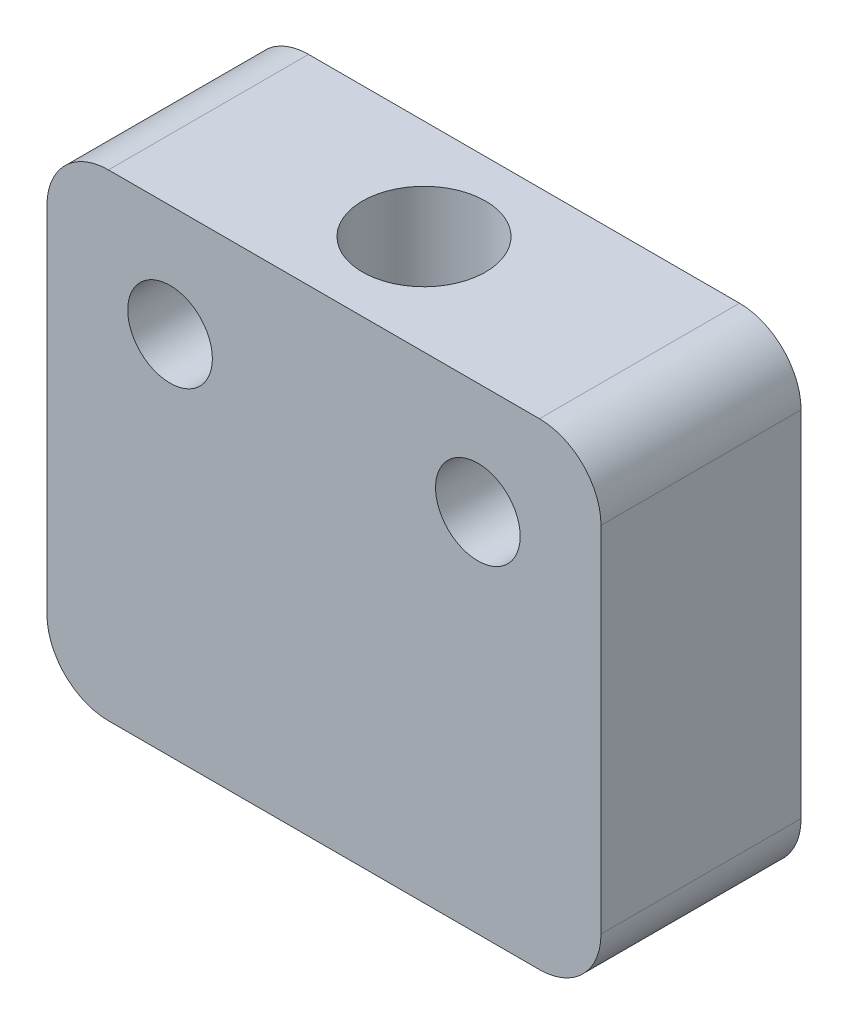
ISO-10303-21;
HEADER;
FILE_DESCRIPTION(('STEP AP214'),'2;1');
FILE_NAME('part.step','',(''),(''),'','','');
FILE_SCHEMA(('AUTOMOTIVE_DESIGN { 1 0 10303 214 1 1 1 1 }'));
ENDSEC;
DATA;
#1=APPLICATION_CONTEXT('core data for automotive mechanical design processes');
#2=APPLICATION_PROTOCOL_DEFINITION('international standard','automotive_design',2000,#1);
#3=PRODUCT_CONTEXT('',#1,'mechanical');
#4=PRODUCT('Part','Part','',(#3));
#5=PRODUCT_RELATED_PRODUCT_CATEGORY('part','',(#4));
#6=PRODUCT_DEFINITION_FORMATION('','',#4);
#7=PRODUCT_DEFINITION_CONTEXT('part definition',#1,'design');
#8=PRODUCT_DEFINITION('design','',#6,#7);
#9=PRODUCT_DEFINITION_SHAPE('','',#8);
#10=(LENGTH_UNIT() NAMED_UNIT(*) SI_UNIT(.MILLI.,.METRE.));
#11=(NAMED_UNIT(*) PLANE_ANGLE_UNIT() SI_UNIT($,.RADIAN.));
#12=(NAMED_UNIT(*) SI_UNIT($,.STERADIAN.) SOLID_ANGLE_UNIT());
#13=UNCERTAINTY_MEASURE_WITH_UNIT(LENGTH_MEASURE(1.E-05),#10,'distance_accuracy_value','');
#14=(GEOMETRIC_REPRESENTATION_CONTEXT(3) GLOBAL_UNCERTAINTY_ASSIGNED_CONTEXT((#13)) GLOBAL_UNIT_ASSIGNED_CONTEXT((#10,
#11,#12)) REPRESENTATION_CONTEXT('',''));
#15=CARTESIAN_POINT('',(0.,0.,0.));
#16=DIRECTION('',(0.,0.,1.));
#17=DIRECTION('',(1.,0.,0.));
#18=AXIS2_PLACEMENT_3D('',#15,#16,#17);
#19=CARTESIAN_POINT('',(18.0000002607703,31.000000461936,6.50000009685755));
#20=DIRECTION('',(0.,-1.,0.));
#21=DIRECTION('',(0.,0.,-1.));
#22=AXIS2_PLACEMENT_3D('',#19,#20,#21);
#23=CYLINDRICAL_SURFACE('',#22,4.);
#24=CARTESIAN_POINT('',(18.0000002607703,0.,6.50000009685755));
#25=DIRECTION('',(0.,-1.,0.));
#26=DIRECTION('',(0.,0.,-1.));
#27=AXIS2_PLACEMENT_3D('',#24,#25,#26);
#28=CIRCLE('',#27,4.);
#29=CARTESIAN_POINT('',(18.0000002607703,0.,2.50000009685755));
#30=VERTEX_POINT('',#29);
#31=EDGE_CURVE('E145',#30,#30,#28,.F.);
#32=ORIENTED_EDGE('',*,*,#31,.F.);
#33=EDGE_LOOP('',(#32));
#34=FACE_BOUND('',#33,.T.);
#35=CARTESIAN_POINT('',(18.0000002607703,31.000000461936,6.50000009685755));
#36=DIRECTION('',(0.,-1.,0.));
#37=DIRECTION('',(0.,0.,-1.));
#38=AXIS2_PLACEMENT_3D('',#35,#36,#37);
#39=CIRCLE('',#38,4.);
#40=CARTESIAN_POINT('',(18.0000002607703,31.000000461936,2.50000009685755));
#41=VERTEX_POINT('',#40);
#42=EDGE_CURVE('E102',#41,#41,#39,.T.);
#43=ORIENTED_EDGE('',*,*,#42,.F.);
#44=EDGE_LOOP('',(#43));
#45=FACE_BOUND('',#44,.T.);
#46=ADVANCED_FACE('F17',(#34,#45),#23,.F.);
#47=CARTESIAN_POINT('',(18.0000002682209,15.500000230968,0.));
#48=DIRECTION('',(0.,0.,1.));
#49=DIRECTION('',(1.,0.,0.));
#50=AXIS2_PLACEMENT_3D('',#47,#48,#49);
#51=PLANE('',#50);
#52=CARTESIAN_POINT('',(8.,23.750000461936,0.));
#53=DIRECTION('',(0.,0.,1.));
#54=DIRECTION('',(1.,0.,0.));
#55=AXIS2_PLACEMENT_3D('',#52,#53,#54);
#56=CIRCLE('',#55,2.75);
#57=CARTESIAN_POINT('',(10.75,23.750000461936,0.));
#58=VERTEX_POINT('',#57);
#59=EDGE_CURVE('E135',#58,#58,#56,.T.);
#60=ORIENTED_EDGE('',*,*,#59,.T.);
#61=EDGE_LOOP('',(#60));
#62=FACE_BOUND('',#61,.T.);
#63=CARTESIAN_POINT('',(28.0000004172325,23.750000461936,0.));
#64=DIRECTION('',(0.,0.,1.));
#65=DIRECTION('',(1.,0.,0.));
#66=AXIS2_PLACEMENT_3D('',#63,#64,#65);
#67=CIRCLE('',#66,2.75);
#68=CARTESIAN_POINT('',(30.7500004172325,23.750000461936,0.));
#69=VERTEX_POINT('',#68);
#70=EDGE_CURVE('E138',#69,#69,#67,.T.);
#71=ORIENTED_EDGE('',*,*,#70,.T.);
#72=EDGE_LOOP('',(#71));
#73=FACE_BOUND('',#72,.T.);
#74=CARTESIAN_POINT('',(32.0000004768372,4.00000005960464,0.));
#75=DIRECTION('',(0.,0.,1.));
#76=DIRECTION('',(1.,0.,0.));
#77=AXIS2_PLACEMENT_3D('',#74,#75,#76);
#78=CIRCLE('',#77,4.00000005960464);
#79=CARTESIAN_POINT('',(32.0000004768372,0.,0.));
#80=VERTEX_POINT('',#79);
#81=CARTESIAN_POINT('',(36.0000002682209,4.00207166144692,0.));
#82=VERTEX_POINT('',#81);
#83=EDGE_CURVE('E141',#80,#82,#78,.T.);
#84=ORIENTED_EDGE('',*,*,#83,.F.);
#85=DIRECTION('',(1.,0.,0.));
#86=VECTOR('',#85,1.);
#87=CARTESIAN_POINT('',(4.00000005960464,0.,0.));
#88=LINE('',#87,#86);
#89=CARTESIAN_POINT('',(4.00000005960464,0.,0.));
#90=VERTEX_POINT('',#89);
#91=EDGE_CURVE('E110',#90,#80,#88,.T.);
#92=ORIENTED_EDGE('',*,*,#91,.F.);
#93=CARTESIAN_POINT('',(4.00000005960464,4.00000005960464,0.));
#94=DIRECTION('',(0.,0.,1.));
#95=DIRECTION('',(1.,0.,0.));
#96=AXIS2_PLACEMENT_3D('',#93,#94,#95);
#97=CIRCLE('',#96,4.00000005960464);
#98=CARTESIAN_POINT('',(4.61936000692095E-07,4.001922424775,0.));
#99=VERTEX_POINT('',#98);
#100=EDGE_CURVE('E148',#99,#90,#97,.T.);
#101=ORIENTED_EDGE('',*,*,#100,.F.);
#102=DIRECTION('',(0.,1.,0.));
#103=VECTOR('',#102,1.);
#104=CARTESIAN_POINT('',(4.61936000561991E-07,27.0000004023314,0.));
#105=LINE('',#104,#103);
#106=CARTESIAN_POINT('',(4.61936000648727E-07,27.0000004023314,0.));
#107=VERTEX_POINT('',#106);
#108=EDGE_CURVE('E115',#107,#99,#105,.F.);
#109=ORIENTED_EDGE('',*,*,#108,.F.);
#110=CARTESIAN_POINT('',(4.00000005960464,27.0000004023314,0.));
#111=DIRECTION('',(0.,0.,1.));
#112=DIRECTION('',(1.,0.,0.));
#113=AXIS2_PLACEMENT_3D('',#110,#111,#112);
#114=CIRCLE('',#113,3.99999959766864);
#115=CARTESIAN_POINT('',(4.00000005960464,31.000000230968,0.));
#116=VERTEX_POINT('',#115);
#117=EDGE_CURVE('E85',#116,#107,#114,.T.);
#118=ORIENTED_EDGE('',*,*,#117,.F.);
#119=DIRECTION('',(1.,0.,0.));
#120=VECTOR('',#119,1.);
#121=CARTESIAN_POINT('',(32.0000004768372,31.000000461936,0.));
#122=LINE('',#121,#120);
#123=CARTESIAN_POINT('',(32.0000004768372,31.000000461936,0.));
#124=VERTEX_POINT('',#123);
#125=EDGE_CURVE('E82',#124,#116,#122,.F.);
#126=ORIENTED_EDGE('',*,*,#125,.F.);
#127=CARTESIAN_POINT('',(32.0000004768372,27.0000004023314,0.));
#128=DIRECTION('',(0.,0.,1.));
#129=DIRECTION('',(1.,0.,0.));
#130=AXIS2_PLACEMENT_3D('',#127,#128,#129);
#131=CIRCLE('',#130,3.99999959766864);
#132=CARTESIAN_POINT('',(36.0000001341105,27.0007724426072,0.));
#133=VERTEX_POINT('',#132);
#134=EDGE_CURVE('E20',#133,#124,#131,.T.);
#135=ORIENTED_EDGE('',*,*,#134,.F.);
#136=DIRECTION('',(0.,1.,0.));
#137=VECTOR('',#136,1.);
#138=CARTESIAN_POINT('',(36.0000005364418,4.00207166144692,0.));
#139=LINE('',#138,#137);
#140=EDGE_CURVE('E97',#82,#133,#139,.T.);
#141=ORIENTED_EDGE('',*,*,#140,.F.);
#142=EDGE_LOOP('',(#84,#92,#101,#109,#118,#126,#135,#141));
#143=FACE_BOUND('',#142,.T.);
#144=ADVANCED_FACE('F83',(#62,#73,#143),#51,.F.);
#145=CARTESIAN_POINT('',(36.0000005364418,4.00207166144692,0.));
#146=DIRECTION('',(1.,0.,0.));
#147=DIRECTION('',(0.,0.,-1.));
#148=AXIS2_PLACEMENT_3D('',#145,#146,#147);
#149=PLANE('',#148);
#150=DIRECTION('',(0.,1.,0.));
#151=VECTOR('',#150,1.);
#152=CARTESIAN_POINT('',(36.,15.500000230968,13.));
#153=LINE('',#152,#151);
#154=CARTESIAN_POINT('',(36.,4.00207166144692,13.));
#155=VERTEX_POINT('',#154);
#156=CARTESIAN_POINT('',(36.,27.0007724426072,13.));
#157=VERTEX_POINT('',#156);
#158=EDGE_CURVE('E134',#155,#157,#153,.T.);
#159=ORIENTED_EDGE('',*,*,#158,.F.);
#160=DIRECTION('',(0.,0.,1.));
#161=VECTOR('',#160,1.);
#162=CARTESIAN_POINT('',(36.,4.00207166144692,0.));
#163=LINE('',#162,#161);
#164=EDGE_CURVE('E144',#82,#155,#163,.T.);
#165=ORIENTED_EDGE('',*,*,#164,.F.);
#166=ORIENTED_EDGE('',*,*,#140,.T.);
#167=DIRECTION('',(0.,0.,1.));
#168=VECTOR('',#167,1.);
#169=CARTESIAN_POINT('',(36.0000000000001,27.0007724426072,0.));
#170=LINE('',#169,#168);
#171=EDGE_CURVE('E90',#157,#133,#170,.F.);
#172=ORIENTED_EDGE('',*,*,#171,.F.);
#173=EDGE_LOOP('',(#159,#165,#166,#172));
#174=FACE_BOUND('',#173,.T.);
#175=ADVANCED_FACE('F211',(#174),#149,.T.);
#176=CARTESIAN_POINT('',(32.0000004768372,27.0000004023314,0.));
#177=DIRECTION('',(0.,0.,1.));
#178=DIRECTION('',(1.,0.,0.));
#179=AXIS2_PLACEMENT_3D('',#176,#177,#178);
#180=CYLINDRICAL_SURFACE('',#179,3.99999959766864);
#181=CARTESIAN_POINT('',(32.0000004768372,27.0000004023314,13.));
#182=DIRECTION('',(0.,0.,1.));
#183=DIRECTION('',(1.,0.,0.));
#184=AXIS2_PLACEMENT_3D('',#181,#182,#183);
#185=CIRCLE('',#184,3.99999959766864);
#186=CARTESIAN_POINT('',(32.0000004768372,31.000000461936,13.));
#187=VERTEX_POINT('',#186);
#188=EDGE_CURVE('E132',#157,#187,#185,.T.);
#189=ORIENTED_EDGE('',*,*,#188,.F.);
#190=ORIENTED_EDGE('',*,*,#171,.T.);
#191=ORIENTED_EDGE('',*,*,#134,.T.);
#192=DIRECTION('',(0.,0.,1.));
#193=VECTOR('',#192,1.);
#194=CARTESIAN_POINT('',(32.0000004768372,31.000000461936,0.));
#195=LINE('',#194,#193);
#196=EDGE_CURVE('E89',#187,#124,#195,.F.);
#197=ORIENTED_EDGE('',*,*,#196,.F.);
#198=EDGE_LOOP('',(#189,#190,#191,#197));
#199=FACE_BOUND('',#198,.T.);
#200=ADVANCED_FACE('F95',(#199),#180,.T.);
#201=CARTESIAN_POINT('',(32.0000004768372,31.000000461936,0.));
#202=DIRECTION('',(0.,1.,0.));
#203=DIRECTION('',(0.,0.,1.));
#204=AXIS2_PLACEMENT_3D('',#201,#202,#203);
#205=PLANE('',#204);
#206=ORIENTED_EDGE('',*,*,#42,.T.);
#207=EDGE_LOOP('',(#206));
#208=FACE_BOUND('',#207,.T.);
#209=DIRECTION('',(1.,0.,0.));
#210=VECTOR('',#209,1.);
#211=CARTESIAN_POINT('',(18.0000002682209,31.000000461936,13.));
#212=LINE('',#211,#210);
#213=CARTESIAN_POINT('',(4.00000005960464,31.000000230968,13.));
#214=VERTEX_POINT('',#213);
#215=EDGE_CURVE('E100',#187,#214,#212,.F.);
#216=ORIENTED_EDGE('',*,*,#215,.F.);
#217=ORIENTED_EDGE('',*,*,#196,.T.);
#218=ORIENTED_EDGE('',*,*,#125,.T.);
#219=DIRECTION('',(0.,0.,1.));
#220=VECTOR('',#219,1.);
#221=CARTESIAN_POINT('',(4.00000005960464,31.,0.));
#222=LINE('',#221,#220);
#223=EDGE_CURVE('E107',#214,#116,#222,.F.);
#224=ORIENTED_EDGE('',*,*,#223,.F.);
#225=EDGE_LOOP('',(#216,#217,#218,#224));
#226=FACE_BOUND('',#225,.T.);
#227=ADVANCED_FACE('F98',(#208,#226),#205,.T.);
#228=CARTESIAN_POINT('',(4.00000005960464,27.0000004023314,0.));
#229=DIRECTION('',(0.,0.,1.));
#230=DIRECTION('',(1.,0.,0.));
#231=AXIS2_PLACEMENT_3D('',#228,#229,#230);
#232=CYLINDRICAL_SURFACE('',#231,3.99999959766864);
#233=CARTESIAN_POINT('',(4.00000005960464,27.0000004023314,13.));
#234=DIRECTION('',(0.,0.,1.));
#235=DIRECTION('',(1.,0.,0.));
#236=AXIS2_PLACEMENT_3D('',#233,#234,#235);
#237=CIRCLE('',#236,3.99999959766864);
#238=CARTESIAN_POINT('',(4.61936000301783E-07,27.0000004023314,13.));
#239=VERTEX_POINT('',#238);
#240=EDGE_CURVE('E129',#214,#239,#237,.T.);
#241=ORIENTED_EDGE('',*,*,#240,.F.);
#242=ORIENTED_EDGE('',*,*,#223,.T.);
#243=ORIENTED_EDGE('',*,*,#117,.T.);
#244=DIRECTION('',(0.,0.,1.));
#245=VECTOR('',#244,1.);
#246=CARTESIAN_POINT('',(4.61936000561991E-07,27.0000004023314,0.));
#247=LINE('',#246,#245);
#248=EDGE_CURVE('E117',#239,#107,#247,.F.);
#249=ORIENTED_EDGE('',*,*,#248,.F.);
#250=EDGE_LOOP('',(#241,#242,#243,#249));
#251=FACE_BOUND('',#250,.T.);
#252=ADVANCED_FACE('F154',(#251),#232,.T.);
#253=CARTESIAN_POINT('',(4.61936000561991E-07,27.0000004023314,0.));
#254=DIRECTION('',(-1.,0.,0.));
#255=DIRECTION('',(0.,0.,1.));
#256=AXIS2_PLACEMENT_3D('',#253,#254,#255);
#257=PLANE('',#256);
#258=DIRECTION('',(0.,1.,0.));
#259=VECTOR('',#258,1.);
#260=CARTESIAN_POINT('',(4.61935999868102E-07,15.500000230968,13.));
#261=LINE('',#260,#259);
#262=CARTESIAN_POINT('',(4.61936000518623E-07,4.001922424775,13.));
#263=VERTEX_POINT('',#262);
#264=EDGE_CURVE('E128',#239,#263,#261,.F.);
#265=ORIENTED_EDGE('',*,*,#264,.F.);
#266=ORIENTED_EDGE('',*,*,#248,.T.);
#267=ORIENTED_EDGE('',*,*,#108,.T.);
#268=DIRECTION('',(0.,0.,1.));
#269=VECTOR('',#268,1.);
#270=CARTESIAN_POINT('',(4.61936000735463E-07,4.001922424775,0.));
#271=LINE('',#270,#269);
#272=EDGE_CURVE('E113',#263,#99,#271,.F.);
#273=ORIENTED_EDGE('',*,*,#272,.F.);
#274=EDGE_LOOP('',(#265,#266,#267,#273));
#275=FACE_BOUND('',#274,.T.);
#276=ADVANCED_FACE('F173',(#275),#257,.T.);
#277=CARTESIAN_POINT('',(4.00000005960464,4.00000005960464,0.));
#278=DIRECTION('',(0.,0.,1.));
#279=DIRECTION('',(1.,0.,0.));
#280=AXIS2_PLACEMENT_3D('',#277,#278,#279);
#281=CYLINDRICAL_SURFACE('',#280,4.00000005960464);
#282=CARTESIAN_POINT('',(4.00000005960464,4.00000005960464,13.));
#283=DIRECTION('',(0.,0.,1.));
#284=DIRECTION('',(1.,0.,0.));
#285=AXIS2_PLACEMENT_3D('',#282,#283,#284);
#286=CIRCLE('',#285,4.00000005960464);
#287=CARTESIAN_POINT('',(4.00000005960464,0.,13.));
#288=VERTEX_POINT('',#287);
#289=EDGE_CURVE('E125',#263,#288,#286,.T.);
#290=ORIENTED_EDGE('',*,*,#289,.F.);
#291=ORIENTED_EDGE('',*,*,#272,.T.);
#292=ORIENTED_EDGE('',*,*,#100,.T.);
#293=DIRECTION('',(0.,0.,-1.));
#294=VECTOR('',#293,1.);
#295=CARTESIAN_POINT('',(4.00000005960464,0.,0.));
#296=LINE('',#295,#294);
#297=EDGE_CURVE('E112',#288,#90,#296,.T.);
#298=ORIENTED_EDGE('',*,*,#297,.F.);
#299=EDGE_LOOP('',(#290,#291,#292,#298));
#300=FACE_BOUND('',#299,.T.);
#301=ADVANCED_FACE('F176',(#300),#281,.T.);
#302=CARTESIAN_POINT('',(4.00000005960464,0.,0.));
#303=DIRECTION('',(0.,-1.,0.));
#304=DIRECTION('',(0.,0.,-1.));
#305=AXIS2_PLACEMENT_3D('',#302,#303,#304);
#306=PLANE('',#305);
#307=ORIENTED_EDGE('',*,*,#31,.T.);
#308=EDGE_LOOP('',(#307));
#309=FACE_BOUND('',#308,.T.);
#310=DIRECTION('',(1.,0.,0.));
#311=VECTOR('',#310,1.);
#312=CARTESIAN_POINT('',(18.0000002682209,0.,13.));
#313=LINE('',#312,#311);
#314=CARTESIAN_POINT('',(32.0000004768372,0.,13.));
#315=VERTEX_POINT('',#314);
#316=EDGE_CURVE('E124',#288,#315,#313,.T.);
#317=ORIENTED_EDGE('',*,*,#316,.F.);
#318=ORIENTED_EDGE('',*,*,#297,.T.);
#319=ORIENTED_EDGE('',*,*,#91,.T.);
#320=DIRECTION('',(0.,0.,1.));
#321=VECTOR('',#320,1.);
#322=CARTESIAN_POINT('',(32.0000004768372,0.,0.));
#323=LINE('',#322,#321);
#324=EDGE_CURVE('E35',#315,#80,#323,.F.);
#325=ORIENTED_EDGE('',*,*,#324,.F.);
#326=EDGE_LOOP('',(#317,#318,#319,#325));
#327=FACE_BOUND('',#326,.T.);
#328=ADVANCED_FACE('F177',(#309,#327),#306,.T.);
#329=CARTESIAN_POINT('',(32.0000004768372,4.00000005960464,0.));
#330=DIRECTION('',(0.,0.,1.));
#331=DIRECTION('',(1.,0.,0.));
#332=AXIS2_PLACEMENT_3D('',#329,#330,#331);
#333=CYLINDRICAL_SURFACE('',#332,4.00000005960464);
#334=CARTESIAN_POINT('',(32.0000004768372,4.00000005960464,13.));
#335=DIRECTION('',(0.,0.,1.));
#336=DIRECTION('',(1.,0.,0.));
#337=AXIS2_PLACEMENT_3D('',#334,#335,#336);
#338=CIRCLE('',#337,4.00000005960464);
#339=EDGE_CURVE('E121',#315,#155,#338,.T.);
#340=ORIENTED_EDGE('',*,*,#339,.F.);
#341=ORIENTED_EDGE('',*,*,#324,.T.);
#342=ORIENTED_EDGE('',*,*,#83,.T.);
#343=ORIENTED_EDGE('',*,*,#164,.T.);
#344=EDGE_LOOP('',(#340,#341,#342,#343));
#345=FACE_BOUND('',#344,.T.);
#346=ADVANCED_FACE('F179',(#345),#333,.T.);
#347=CARTESIAN_POINT('',(28.0000004172325,23.750000461936,0.));
#348=DIRECTION('',(0.,0.,1.));
#349=DIRECTION('',(1.,0.,0.));
#350=AXIS2_PLACEMENT_3D('',#347,#348,#349);
#351=CYLINDRICAL_SURFACE('',#350,2.75);
#352=ORIENTED_EDGE('',*,*,#70,.F.);
#353=EDGE_LOOP('',(#352));
#354=FACE_BOUND('',#353,.T.);
#355=CARTESIAN_POINT('',(28.0000004172325,23.750000461936,13.));
#356=DIRECTION('',(0.,0.,1.));
#357=DIRECTION('',(1.,0.,0.));
#358=AXIS2_PLACEMENT_3D('',#355,#356,#357);
#359=CIRCLE('',#358,2.75);
#360=CARTESIAN_POINT('',(30.7500004172325,23.750000461936,13.));
#361=VERTEX_POINT('',#360);
#362=EDGE_CURVE('E26',#361,#361,#359,.F.);
#363=ORIENTED_EDGE('',*,*,#362,.F.);
#364=EDGE_LOOP('',(#363));
#365=FACE_BOUND('',#364,.T.);
#366=ADVANCED_FACE('F187',(#354,#365),#351,.F.);
#367=CARTESIAN_POINT('',(8.,23.750000461936,0.));
#368=DIRECTION('',(0.,0.,1.));
#369=DIRECTION('',(1.,0.,0.));
#370=AXIS2_PLACEMENT_3D('',#367,#368,#369);
#371=CYLINDRICAL_SURFACE('',#370,2.75);
#372=ORIENTED_EDGE('',*,*,#59,.F.);
#373=EDGE_LOOP('',(#372));
#374=FACE_BOUND('',#373,.T.);
#375=CARTESIAN_POINT('',(8.,23.750000461936,13.));
#376=DIRECTION('',(0.,0.,1.));
#377=DIRECTION('',(1.,0.,0.));
#378=AXIS2_PLACEMENT_3D('',#375,#376,#377);
#379=CIRCLE('',#378,2.75);
#380=CARTESIAN_POINT('',(10.75,23.750000461936,13.));
#381=VERTEX_POINT('',#380);
#382=EDGE_CURVE('E11',#381,#381,#379,.F.);
#383=ORIENTED_EDGE('',*,*,#382,.F.);
#384=EDGE_LOOP('',(#383));
#385=FACE_BOUND('',#384,.T.);
#386=ADVANCED_FACE('F192',(#374,#385),#371,.F.);
#387=CARTESIAN_POINT('',(18.0000002682209,15.500000230968,13.));
#388=DIRECTION('',(0.,0.,1.));
#389=DIRECTION('',(1.,0.,0.));
#390=AXIS2_PLACEMENT_3D('',#387,#388,#389);
#391=PLANE('',#390);
#392=ORIENTED_EDGE('',*,*,#382,.T.);
#393=EDGE_LOOP('',(#392));
#394=FACE_BOUND('',#393,.T.);
#395=ORIENTED_EDGE('',*,*,#362,.T.);
#396=EDGE_LOOP('',(#395));
#397=FACE_BOUND('',#396,.T.);
#398=ORIENTED_EDGE('',*,*,#316,.T.);
#399=ORIENTED_EDGE('',*,*,#339,.T.);
#400=ORIENTED_EDGE('',*,*,#158,.T.);
#401=ORIENTED_EDGE('',*,*,#188,.T.);
#402=ORIENTED_EDGE('',*,*,#215,.T.);
#403=ORIENTED_EDGE('',*,*,#240,.T.);
#404=ORIENTED_EDGE('',*,*,#264,.T.);
#405=ORIENTED_EDGE('',*,*,#289,.T.);
#406=EDGE_LOOP('',(#398,#399,#400,#401,#402,#403,#404,#405));
#407=FACE_BOUND('',#406,.T.);
#408=ADVANCED_FACE('F159',(#394,#397,#407),#391,.T.);
#409=CLOSED_SHELL('',(#46,#144,#175,#200,#227,#252,#276,#301,#328,#346,#366,#386,#408));
#410=MANIFOLD_SOLID_BREP('B1',#409);
#411=ADVANCED_BREP_SHAPE_REPRESENTATION('',(#18,#410),#14);
#412=SHAPE_DEFINITION_REPRESENTATION(#9,#411);
ENDSEC;
END-ISO-10303-21;
